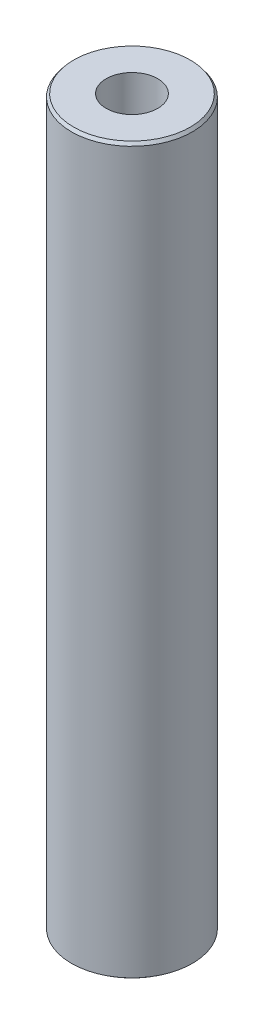
ISO-10303-21;
HEADER;
FILE_DESCRIPTION(('STEP AP214'),'2;1');
FILE_NAME('part.step','',(''),(''),'','','');
FILE_SCHEMA(('AUTOMOTIVE_DESIGN { 1 0 10303 214 1 1 1 1 }'));
ENDSEC;
DATA;
#1=APPLICATION_CONTEXT('core data for automotive mechanical design processes');
#2=APPLICATION_PROTOCOL_DEFINITION('international standard','automotive_design',2000,#1);
#3=PRODUCT_CONTEXT('',#1,'mechanical');
#4=PRODUCT('Part','Part','',(#3));
#5=PRODUCT_RELATED_PRODUCT_CATEGORY('part','',(#4));
#6=PRODUCT_DEFINITION_FORMATION('','',#4);
#7=PRODUCT_DEFINITION_CONTEXT('part definition',#1,'design');
#8=PRODUCT_DEFINITION('design','',#6,#7);
#9=PRODUCT_DEFINITION_SHAPE('','',#8);
#10=(LENGTH_UNIT() NAMED_UNIT(*) SI_UNIT(.MILLI.,.METRE.));
#11=(NAMED_UNIT(*) PLANE_ANGLE_UNIT() SI_UNIT($,.RADIAN.));
#12=(NAMED_UNIT(*) SI_UNIT($,.STERADIAN.) SOLID_ANGLE_UNIT());
#13=UNCERTAINTY_MEASURE_WITH_UNIT(LENGTH_MEASURE(1.E-05),#10,'distance_accuracy_value','');
#14=(GEOMETRIC_REPRESENTATION_CONTEXT(3) GLOBAL_UNCERTAINTY_ASSIGNED_CONTEXT((#13)) GLOBAL_UNIT_ASSIGNED_CONTEXT((#10,
#11,#12)) REPRESENTATION_CONTEXT('',''));
#15=CARTESIAN_POINT('',(0.,0.,0.));
#16=DIRECTION('',(0.,0.,1.));
#17=DIRECTION('',(1.,0.,0.));
#18=AXIS2_PLACEMENT_3D('',#15,#16,#17);
#19=CARTESIAN_POINT('',(0.,600.,0.));
#20=DIRECTION('',(0.,-1.,0.));
#21=DIRECTION('',(0.,0.,-1.));
#22=AXIS2_PLACEMENT_3D('',#19,#20,#21);
#23=CYLINDRICAL_SURFACE('',#22,50.);
#24=CARTESIAN_POINT('',(0.,597.542891677269,0.));
#25=DIRECTION('',(0.,1.,0.));
#26=DIRECTION('',(0.,0.,1.));
#27=AXIS2_PLACEMENT_3D('',#24,#25,#26);
#28=CIRCLE('',#27,50.);
#29=CARTESIAN_POINT('',(0.,597.542891677269,50.));
#30=VERTEX_POINT('',#29);
#31=EDGE_CURVE('E50',#30,#30,#28,.F.);
#32=ORIENTED_EDGE('',*,*,#31,.T.);
#33=EDGE_LOOP('',(#32));
#34=FACE_BOUND('',#33,.T.);
#35=CARTESIAN_POINT('',(0.,1.82391104740398,0.));
#36=DIRECTION('',(0.,1.,0.));
#37=DIRECTION('',(0.,0.,1.));
#38=AXIS2_PLACEMENT_3D('',#35,#36,#37);
#39=CIRCLE('',#38,50.);
#40=CARTESIAN_POINT('',(0.,1.82391104740398,50.));
#41=VERTEX_POINT('',#40);
#42=EDGE_CURVE('E51',#41,#41,#39,.T.);
#43=ORIENTED_EDGE('',*,*,#42,.T.);
#44=EDGE_LOOP('',(#43));
#45=FACE_BOUND('',#44,.T.);
#46=ADVANCED_FACE('F39',(#34,#45),#23,.T.);
#47=CARTESIAN_POINT('',(0.,600.,0.));
#48=DIRECTION('',(0.,1.,0.));
#49=DIRECTION('',(0.,0.,1.));
#50=AXIS2_PLACEMENT_3D('',#47,#48,#49);
#51=PLANE('',#50);
#52=CARTESIAN_POINT('',(0.,600.,0.));
#53=DIRECTION('',(0.,1.,0.));
#54=DIRECTION('',(0.,0.,1.));
#55=AXIS2_PLACEMENT_3D('',#52,#53,#54);
#56=CIRCLE('',#55,48.176088952596);
#57=CARTESIAN_POINT('',(0.,600.,48.176088952596));
#58=VERTEX_POINT('',#57);
#59=EDGE_CURVE('E54',#58,#58,#56,.T.);
#60=ORIENTED_EDGE('',*,*,#59,.T.);
#61=EDGE_LOOP('',(#60));
#62=FACE_BOUND('',#61,.T.);
#63=CARTESIAN_POINT('',(0.,600.,0.));
#64=DIRECTION('',(0.,1.,0.));
#65=DIRECTION('',(0.,0.,1.));
#66=AXIS2_PLACEMENT_3D('',#63,#64,#65);
#67=CIRCLE('',#66,21.3255991959635);
#68=CARTESIAN_POINT('',(0.,600.,21.3255991959635));
#69=VERTEX_POINT('',#68);
#70=EDGE_CURVE('E58',#69,#69,#67,.T.);
#71=ORIENTED_EDGE('',*,*,#70,.F.);
#72=EDGE_LOOP('',(#71));
#73=FACE_BOUND('',#72,.T.);
#74=ADVANCED_FACE('F69',(#62,#73),#51,.T.);
#75=CARTESIAN_POINT('',(0.,0.,0.));
#76=DIRECTION('',(0.,1.,0.));
#77=DIRECTION('',(0.,0.,1.));
#78=AXIS2_PLACEMENT_3D('',#75,#76,#77);
#79=PLANE('',#78);
#80=CARTESIAN_POINT('',(0.,0.,0.));
#81=DIRECTION('',(0.,1.,0.));
#82=DIRECTION('',(0.,0.,1.));
#83=AXIS2_PLACEMENT_3D('',#80,#81,#82);
#84=CIRCLE('',#83,47.5428916772694);
#85=CARTESIAN_POINT('',(0.,0.,47.5428916772694));
#86=VERTEX_POINT('',#85);
#87=EDGE_CURVE('E10',#86,#86,#84,.F.);
#88=ORIENTED_EDGE('',*,*,#87,.T.);
#89=EDGE_LOOP('',(#88));
#90=FACE_BOUND('',#89,.T.);
#91=CARTESIAN_POINT('',(0.,0.,0.));
#92=DIRECTION('',(0.,1.,0.));
#93=DIRECTION('',(0.,0.,1.));
#94=AXIS2_PLACEMENT_3D('',#91,#92,#93);
#95=CIRCLE('',#94,21.3255991959635);
#96=CARTESIAN_POINT('',(0.,0.,21.3255991959635));
#97=VERTEX_POINT('',#96);
#98=EDGE_CURVE('E63',#97,#97,#95,.T.);
#99=ORIENTED_EDGE('',*,*,#98,.T.);
#100=EDGE_LOOP('',(#99));
#101=FACE_BOUND('',#100,.T.);
#102=ADVANCED_FACE('F75',(#90,#101),#79,.F.);
#103=CARTESIAN_POINT('',(0.,600.,0.));
#104=DIRECTION('',(0.,-1.,0.));
#105=DIRECTION('',(0.,0.,-1.));
#106=AXIS2_PLACEMENT_3D('',#103,#104,#105);
#107=CYLINDRICAL_SURFACE('',#106,21.3255991959635);
#108=ORIENTED_EDGE('',*,*,#70,.T.);
#109=EDGE_LOOP('',(#108));
#110=FACE_BOUND('',#109,.T.);
#111=ORIENTED_EDGE('',*,*,#98,.F.);
#112=EDGE_LOOP('',(#111));
#113=FACE_BOUND('',#112,.T.);
#114=ADVANCED_FACE('F70',(#110,#113),#107,.F.);
#115=CARTESIAN_POINT('',(0.,600.,0.));
#116=DIRECTION('',(0.,-1.,0.));
#117=DIRECTION('',(0.,0.,-1.));
#118=AXIS2_PLACEMENT_3D('',#115,#116,#117);
#119=CONICAL_SURFACE('',#118,48.176088952596,0.638554746824539);
#120=ORIENTED_EDGE('',*,*,#31,.F.);
#121=EDGE_LOOP('',(#120));
#122=FACE_BOUND('',#121,.T.);
#123=ORIENTED_EDGE('',*,*,#59,.F.);
#124=EDGE_LOOP('',(#123));
#125=FACE_BOUND('',#124,.T.);
#126=ADVANCED_FACE('F81',(#122,#125),#119,.T.);
#127=CARTESIAN_POINT('',(0.,1.82391104740398,0.));
#128=DIRECTION('',(0.,1.,0.));
#129=DIRECTION('',(0.,0.,1.));
#130=AXIS2_PLACEMENT_3D('',#127,#128,#129);
#131=CONICAL_SURFACE('',#130,50.,0.932241579970363);
#132=ORIENTED_EDGE('',*,*,#87,.F.);
#133=EDGE_LOOP('',(#132));
#134=FACE_BOUND('',#133,.T.);
#135=ORIENTED_EDGE('',*,*,#42,.F.);
#136=EDGE_LOOP('',(#135));
#137=FACE_BOUND('',#136,.T.);
#138=ADVANCED_FACE('F45',(#134,#137),#131,.T.);
#139=CLOSED_SHELL('',(#46,#74,#102,#114,#126,#138));
#140=MANIFOLD_SOLID_BREP('B2',#139);
#141=ADVANCED_BREP_SHAPE_REPRESENTATION('',(#18,#140),#14);
#142=SHAPE_DEFINITION_REPRESENTATION(#9,#141);
ENDSEC;
END-ISO-10303-21;
